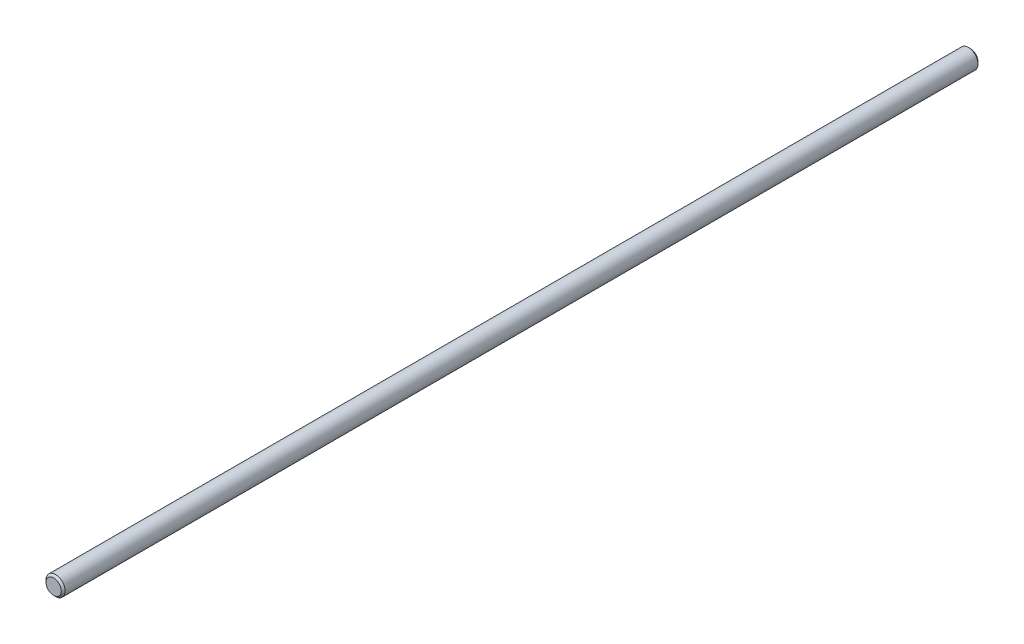
ISO-10303-21;
HEADER;
FILE_DESCRIPTION(('STEP AP214'),'2;1');
FILE_NAME('part.step','',(''),(''),'','','');
FILE_SCHEMA(('AUTOMOTIVE_DESIGN { 1 0 10303 214 1 1 1 1 }'));
ENDSEC;
DATA;
#1=APPLICATION_CONTEXT('core data for automotive mechanical design processes');
#2=APPLICATION_PROTOCOL_DEFINITION('international standard','automotive_design',2000,#1);
#3=PRODUCT_CONTEXT('',#1,'mechanical');
#4=PRODUCT('Part','Part','',(#3));
#5=PRODUCT_RELATED_PRODUCT_CATEGORY('part','',(#4));
#6=PRODUCT_DEFINITION_FORMATION('','',#4);
#7=PRODUCT_DEFINITION_CONTEXT('part definition',#1,'design');
#8=PRODUCT_DEFINITION('design','',#6,#7);
#9=PRODUCT_DEFINITION_SHAPE('','',#8);
#10=(LENGTH_UNIT() NAMED_UNIT(*) SI_UNIT(.MILLI.,.METRE.));
#11=(NAMED_UNIT(*) PLANE_ANGLE_UNIT() SI_UNIT($,.RADIAN.));
#12=(NAMED_UNIT(*) SI_UNIT($,.STERADIAN.) SOLID_ANGLE_UNIT());
#13=UNCERTAINTY_MEASURE_WITH_UNIT(LENGTH_MEASURE(1.E-05),#10,'distance_accuracy_value','');
#14=(GEOMETRIC_REPRESENTATION_CONTEXT(3) GLOBAL_UNCERTAINTY_ASSIGNED_CONTEXT((#13)) GLOBAL_UNIT_ASSIGNED_CONTEXT((#10,
#11,#12)) REPRESENTATION_CONTEXT('',''));
#15=CARTESIAN_POINT('',(0.,0.,0.));
#16=DIRECTION('',(0.,0.,1.));
#17=DIRECTION('',(1.,0.,0.));
#18=AXIS2_PLACEMENT_3D('',#15,#16,#17);
#19=CARTESIAN_POINT('',(0.,0.,152.4));
#20=DIRECTION('',(0.,0.,-1.));
#21=DIRECTION('',(-1.,0.,0.));
#22=AXIS2_PLACEMENT_3D('',#19,#20,#21);
#23=CYLINDRICAL_SURFACE('',#22,3.175);
#24=CARTESIAN_POINT('',(0.,0.,-151.765));
#25=DIRECTION('',(0.,0.,1.));
#26=DIRECTION('',(1.,0.,0.));
#27=AXIS2_PLACEMENT_3D('',#24,#25,#26);
#28=CIRCLE('',#27,3.175);
#29=CARTESIAN_POINT('',(3.175,0.,-151.765));
#30=VERTEX_POINT('',#29);
#31=EDGE_CURVE('E41',#30,#30,#28,.T.);
#32=ORIENTED_EDGE('',*,*,#31,.T.);
#33=EDGE_LOOP('',(#32));
#34=FACE_BOUND('',#33,.T.);
#35=CARTESIAN_POINT('',(0.,0.,151.765));
#36=DIRECTION('',(0.,0.,1.));
#37=DIRECTION('',(1.,0.,0.));
#38=AXIS2_PLACEMENT_3D('',#35,#36,#37);
#39=CIRCLE('',#38,3.175);
#40=CARTESIAN_POINT('',(3.175,0.,151.765));
#41=VERTEX_POINT('',#40);
#42=EDGE_CURVE('E45',#41,#41,#39,.F.);
#43=ORIENTED_EDGE('',*,*,#42,.T.);
#44=EDGE_LOOP('',(#43));
#45=FACE_BOUND('',#44,.T.);
#46=ADVANCED_FACE('F30',(#34,#45),#23,.T.);
#47=CARTESIAN_POINT('',(0.,0.,152.4));
#48=DIRECTION('',(0.,0.,1.));
#49=DIRECTION('',(1.,0.,0.));
#50=AXIS2_PLACEMENT_3D('',#47,#48,#49);
#51=PLANE('',#50);
#52=CARTESIAN_POINT('',(0.,0.,152.4));
#53=DIRECTION('',(0.,0.,1.));
#54=DIRECTION('',(1.,0.,0.));
#55=AXIS2_PLACEMENT_3D('',#52,#53,#54);
#56=CIRCLE('',#55,2.54000000000024);
#57=CARTESIAN_POINT('',(2.54000000000024,0.,152.4));
#58=VERTEX_POINT('',#57);
#59=EDGE_CURVE('E10',#58,#58,#56,.T.);
#60=ORIENTED_EDGE('',*,*,#59,.T.);
#61=EDGE_LOOP('',(#60));
#62=FACE_BOUND('',#61,.T.);
#63=ADVANCED_FACE('F61',(#62),#51,.T.);
#64=CARTESIAN_POINT('',(0.,0.,-152.4));
#65=DIRECTION('',(0.,0.,1.));
#66=DIRECTION('',(1.,0.,0.));
#67=AXIS2_PLACEMENT_3D('',#64,#65,#66);
#68=PLANE('',#67);
#69=CARTESIAN_POINT('',(0.,0.,-152.4));
#70=DIRECTION('',(0.,0.,1.));
#71=DIRECTION('',(1.,0.,0.));
#72=AXIS2_PLACEMENT_3D('',#69,#70,#71);
#73=CIRCLE('',#72,2.53999999999979);
#74=CARTESIAN_POINT('',(2.53999999999979,0.,-152.4));
#75=VERTEX_POINT('',#74);
#76=EDGE_CURVE('E37',#75,#75,#73,.F.);
#77=ORIENTED_EDGE('',*,*,#76,.T.);
#78=EDGE_LOOP('',(#77));
#79=FACE_BOUND('',#78,.T.);
#80=ADVANCED_FACE('F58',(#79),#68,.F.);
#81=CARTESIAN_POINT('',(0.,0.,-151.765));
#82=DIRECTION('',(0.,0.,1.));
#83=DIRECTION('',(1.,0.,0.));
#84=AXIS2_PLACEMENT_3D('',#81,#82,#83);
#85=CONICAL_SURFACE('',#84,3.175,0.785398163397441);
#86=ORIENTED_EDGE('',*,*,#76,.F.);
#87=EDGE_LOOP('',(#86));
#88=FACE_BOUND('',#87,.T.);
#89=ORIENTED_EDGE('',*,*,#31,.F.);
#90=EDGE_LOOP('',(#89));
#91=FACE_BOUND('',#90,.T.);
#92=ADVANCED_FACE('F54',(#88,#91),#85,.T.);
#93=CARTESIAN_POINT('',(0.,0.,152.4));
#94=DIRECTION('',(0.,0.,-1.));
#95=DIRECTION('',(-1.,0.,0.));
#96=AXIS2_PLACEMENT_3D('',#93,#94,#95);
#97=CONICAL_SURFACE('',#96,2.54000000000024,0.785398163397441);
#98=ORIENTED_EDGE('',*,*,#42,.F.);
#99=EDGE_LOOP('',(#98));
#100=FACE_BOUND('',#99,.T.);
#101=ORIENTED_EDGE('',*,*,#59,.F.);
#102=EDGE_LOOP('',(#101));
#103=FACE_BOUND('',#102,.T.);
#104=ADVANCED_FACE('F32',(#100,#103),#97,.T.);
#105=CLOSED_SHELL('',(#46,#63,#80,#92,#104));
#106=MANIFOLD_SOLID_BREP('B2',#105);
#107=ADVANCED_BREP_SHAPE_REPRESENTATION('',(#18,#106),#14);
#108=SHAPE_DEFINITION_REPRESENTATION(#9,#107);
ENDSEC;
END-ISO-10303-21;
